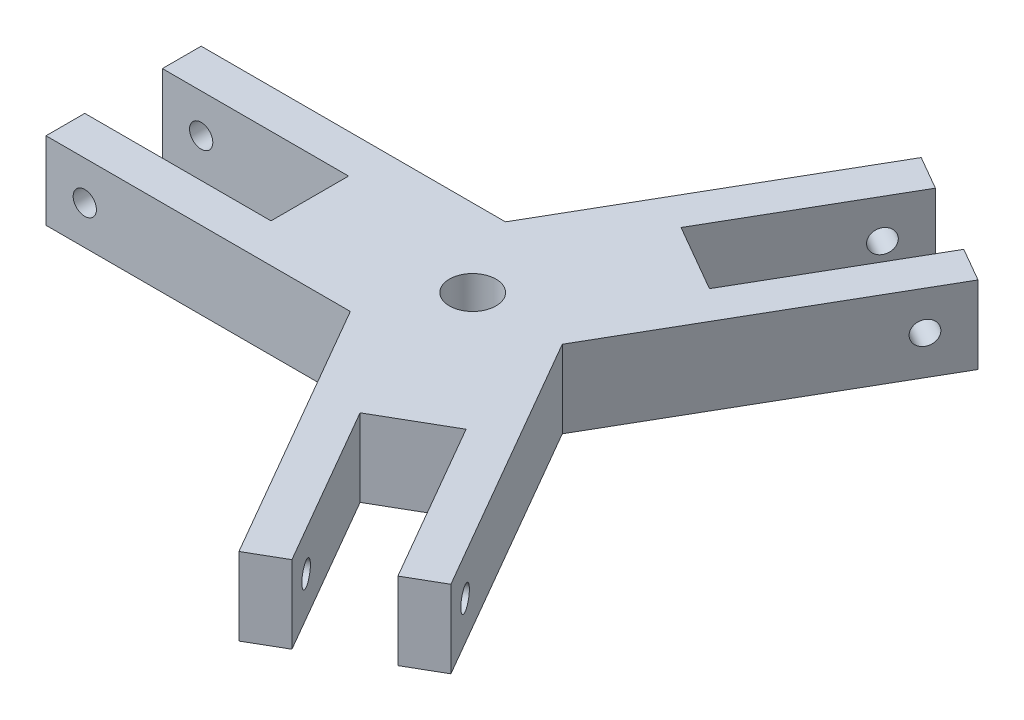
ISO-10303-21;
HEADER;
FILE_DESCRIPTION(('STEP AP214'),'2;1');
FILE_NAME('part.step','',(''),(''),'','','');
FILE_SCHEMA(('AUTOMOTIVE_DESIGN { 1 0 10303 214 1 1 1 1 }'));
ENDSEC;
DATA;
#1=APPLICATION_CONTEXT('core data for automotive mechanical design processes');
#2=APPLICATION_PROTOCOL_DEFINITION('international standard','automotive_design',2000,#1);
#3=PRODUCT_CONTEXT('',#1,'mechanical');
#4=PRODUCT('Part','Part','',(#3));
#5=PRODUCT_RELATED_PRODUCT_CATEGORY('part','',(#4));
#6=PRODUCT_DEFINITION_FORMATION('','',#4);
#7=PRODUCT_DEFINITION_CONTEXT('part definition',#1,'design');
#8=PRODUCT_DEFINITION('design','',#6,#7);
#9=PRODUCT_DEFINITION_SHAPE('','',#8);
#10=(LENGTH_UNIT() NAMED_UNIT(*) SI_UNIT(.MILLI.,.METRE.));
#11=(NAMED_UNIT(*) PLANE_ANGLE_UNIT() SI_UNIT($,.RADIAN.));
#12=(NAMED_UNIT(*) SI_UNIT($,.STERADIAN.) SOLID_ANGLE_UNIT());
#13=UNCERTAINTY_MEASURE_WITH_UNIT(LENGTH_MEASURE(1.E-05),#10,'distance_accuracy_value','');
#14=(GEOMETRIC_REPRESENTATION_CONTEXT(3) GLOBAL_UNCERTAINTY_ASSIGNED_CONTEXT((#13)) GLOBAL_UNIT_ASSIGNED_CONTEXT((#10,
#11,#12)) REPRESENTATION_CONTEXT('',''));
#15=CARTESIAN_POINT('',(0.,0.,0.));
#16=DIRECTION('',(0.,0.,1.));
#17=DIRECTION('',(1.,0.,0.));
#18=AXIS2_PLACEMENT_3D('',#15,#16,#17);
#19=CARTESIAN_POINT('',(13.8397459621552,0.,-43.9711431702999));
#20=DIRECTION('',(-0.499999999999992,0.,0.866025403784443));
#21=DIRECTION('',(0.866025403784443,0.,0.499999999999992));
#22=AXIS2_PLACEMENT_3D('',#19,#20,#21);
#23=PLANE('',#22);
#24=DIRECTION('',(0.866025403784443,0.,0.499999999999992));
#25=VECTOR('',#24,1.);
#26=CARTESIAN_POINT('',(13.8397459621552,9.99999999999999,-43.9711431702999));
#27=LINE('',#26,#25);
#28=CARTESIAN_POINT('',(13.8397459621552,9.99999999999999,-43.9711431702999));
#29=VERTEX_POINT('',#28);
#30=CARTESIAN_POINT('',(18.1698729810774,9.99999999999999,-41.4711431702999));
#31=VERTEX_POINT('',#30);
#32=EDGE_CURVE('E268',#29,#31,#27,.T.);
#33=ORIENTED_EDGE('',*,*,#32,.T.);
#34=DIRECTION('',(0.,1.,0.));
#35=VECTOR('',#34,1.);
#36=CARTESIAN_POINT('',(18.1698729810774,0.,-41.4711431702999));
#37=LINE('',#36,#35);
#38=CARTESIAN_POINT('',(18.1698729810774,0.,-41.4711431702999));
#39=VERTEX_POINT('',#38);
#40=EDGE_CURVE('E213',#39,#31,#37,.T.);
#41=ORIENTED_EDGE('',*,*,#40,.F.);
#42=DIRECTION('',(0.866025403784443,0.,0.499999999999992));
#43=VECTOR('',#42,1.);
#44=CARTESIAN_POINT('',(13.8397459621552,0.,-43.9711431702999));
#45=LINE('',#44,#43);
#46=CARTESIAN_POINT('',(13.8397459621552,0.,-43.9711431702999));
#47=VERTEX_POINT('',#46);
#48=EDGE_CURVE('E265',#47,#39,#45,.T.);
#49=ORIENTED_EDGE('',*,*,#48,.F.);
#50=DIRECTION('',(0.,-1.,0.));
#51=VECTOR('',#50,1.);
#52=CARTESIAN_POINT('',(13.8397459621552,0.,-43.9711431702999));
#53=LINE('',#52,#51);
#54=EDGE_CURVE('E252',#29,#47,#53,.T.);
#55=ORIENTED_EDGE('',*,*,#54,.F.);
#56=EDGE_LOOP('',(#33,#41,#49,#55));
#57=FACE_BOUND('',#56,.T.);
#58=ADVANCED_FACE('F33',(#57),#23,.F.);
#59=CARTESIAN_POINT('',(62.4102540378442,5.,-10.1554445662283));
#60=DIRECTION('',(-0.866025403784443,0.,-0.499999999999992));
#61=DIRECTION('',(-0.499999999999992,0.,0.866025403784443));
#62=AXIS2_PLACEMENT_3D('',#59,#60,#61);
#63=CYLINDRICAL_SURFACE('',#62,1.5);
#64=CARTESIAN_POINT('',(15.6698729810775,5.,-37.1410161513777));
#65=DIRECTION('',(-0.866025403784443,0.,-0.499999999999992));
#66=DIRECTION('',(-0.499999999999992,0.,0.866025403784443));
#67=AXIS2_PLACEMENT_3D('',#64,#65,#66);
#68=CIRCLE('',#67,1.5);
#69=CARTESIAN_POINT('',(14.9198729810775,5.,-35.841978045701));
#70=VERTEX_POINT('',#69);
#71=EDGE_CURVE('E37',#70,#70,#68,.F.);
#72=ORIENTED_EDGE('',*,*,#71,.T.);
#73=EDGE_LOOP('',(#72));
#74=FACE_BOUND('',#73,.T.);
#75=CARTESIAN_POINT('',(11.3397459621553,5.,-39.6410161513776));
#76=DIRECTION('',(-0.866025403784443,0.,-0.499999999999992));
#77=DIRECTION('',(-0.499999999999992,0.,0.866025403784443));
#78=AXIS2_PLACEMENT_3D('',#75,#76,#77);
#79=CIRCLE('',#78,1.5);
#80=CARTESIAN_POINT('',(10.5897459621553,5.,-38.341978045701));
#81=VERTEX_POINT('',#80);
#82=EDGE_CURVE('E241',#81,#81,#79,.T.);
#83=ORIENTED_EDGE('',*,*,#82,.T.);
#84=EDGE_LOOP('',(#83));
#85=FACE_BOUND('',#84,.T.);
#86=ADVANCED_FACE('F375',(#74,#85),#63,.F.);
#87=CARTESIAN_POINT('',(31.1602540378445,0.,33.9711431702996));
#88=DIRECTION('',(-0.500000000000004,0.,-0.866025403784436));
#89=DIRECTION('',(-0.866025403784436,0.,0.500000000000004));
#90=AXIS2_PLACEMENT_3D('',#87,#88,#89);
#91=PLANE('',#90);
#92=DIRECTION('',(-0.866025403784436,0.,0.500000000000004));
#93=VECTOR('',#92,1.);
#94=CARTESIAN_POINT('',(31.1602540378445,9.99999999999999,33.9711431702996));
#95=LINE('',#94,#93);
#96=CARTESIAN_POINT('',(31.1602540378445,9.99999999999999,33.9711431702996));
#97=VERTEX_POINT('',#96);
#98=CARTESIAN_POINT('',(26.8301270189224,9.99999999999999,36.4711431702996));
#99=VERTEX_POINT('',#98);
#100=EDGE_CURVE('E292',#97,#99,#95,.T.);
#101=ORIENTED_EDGE('',*,*,#100,.T.);
#102=DIRECTION('',(0.,1.,0.));
#103=VECTOR('',#102,1.);
#104=CARTESIAN_POINT('',(26.8301270189224,0.,36.4711431702996));
#105=LINE('',#104,#103);
#106=CARTESIAN_POINT('',(26.8301270189224,0.,36.4711431702996));
#107=VERTEX_POINT('',#106);
#108=EDGE_CURVE('E236',#107,#99,#105,.T.);
#109=ORIENTED_EDGE('',*,*,#108,.F.);
#110=DIRECTION('',(-0.866025403784436,0.,0.500000000000004));
#111=VECTOR('',#110,1.);
#112=CARTESIAN_POINT('',(31.1602540378445,0.,33.9711431702996));
#113=LINE('',#112,#111);
#114=CARTESIAN_POINT('',(31.1602540378445,0.,33.9711431702996));
#115=VERTEX_POINT('',#114);
#116=EDGE_CURVE('E288',#115,#107,#113,.T.);
#117=ORIENTED_EDGE('',*,*,#116,.F.);
#118=DIRECTION('',(0.,-1.,0.));
#119=VECTOR('',#118,1.);
#120=CARTESIAN_POINT('',(31.1602540378445,0.,33.9711431702996));
#121=LINE('',#120,#119);
#122=EDGE_CURVE('E274',#97,#115,#121,.T.);
#123=ORIENTED_EDGE('',*,*,#122,.F.);
#124=EDGE_LOOP('',(#101,#109,#117,#123));
#125=FACE_BOUND('',#124,.T.);
#126=ADVANCED_FACE('F399',(#125),#91,.F.);
#127=CARTESIAN_POINT('',(-32.7900635094608,5.,65.1193735291025));
#128=DIRECTION('',(0.866025403784436,0.,-0.500000000000004));
#129=DIRECTION('',(-0.500000000000004,0.,-0.866025403784436));
#130=AXIS2_PLACEMENT_3D('',#127,#128,#129);
#131=CYLINDRICAL_SURFACE('',#130,1.5);
#132=CARTESIAN_POINT('',(24.3301270189224,5.,32.1410161513774));
#133=DIRECTION('',(0.866025403784436,0.,-0.500000000000004));
#134=DIRECTION('',(-0.500000000000004,0.,-0.866025403784436));
#135=AXIS2_PLACEMENT_3D('',#132,#133,#134);
#136=CIRCLE('',#135,1.5);
#137=CARTESIAN_POINT('',(23.5801270189224,5.,30.8419780457008));
#138=VERTEX_POINT('',#137);
#139=EDGE_CURVE('E365',#138,#138,#136,.F.);
#140=ORIENTED_EDGE('',*,*,#139,.T.);
#141=EDGE_LOOP('',(#140));
#142=FACE_BOUND('',#141,.T.);
#143=CARTESIAN_POINT('',(28.6602540378445,5.,29.6410161513774));
#144=DIRECTION('',(0.866025403784436,0.,-0.500000000000004));
#145=DIRECTION('',(-0.500000000000004,0.,-0.866025403784436));
#146=AXIS2_PLACEMENT_3D('',#143,#144,#145);
#147=CIRCLE('',#146,1.5);
#148=CARTESIAN_POINT('',(27.9102540378445,5.,28.3419780457008));
#149=VERTEX_POINT('',#148);
#150=EDGE_CURVE('E246',#149,#149,#147,.T.);
#151=ORIENTED_EDGE('',*,*,#150,.T.);
#152=EDGE_LOOP('',(#151));
#153=FACE_BOUND('',#152,.T.);
#154=ADVANCED_FACE('F521',(#142,#153),#131,.F.);
#155=CARTESIAN_POINT('',(0.,0.,10.));
#156=DIRECTION('',(0.,0.,1.));
#157=DIRECTION('',(1.,0.,0.));
#158=AXIS2_PLACEMENT_3D('',#155,#156,#157);
#159=PLANE('',#158);
#160=CARTESIAN_POINT('',(-40.,5.,10.));
#161=DIRECTION('',(0.,0.,1.));
#162=DIRECTION('',(1.,0.,0.));
#163=AXIS2_PLACEMENT_3D('',#160,#161,#162);
#164=CIRCLE('',#163,1.5);
#165=CARTESIAN_POINT('',(-38.5,5.,10.));
#166=VERTEX_POINT('',#165);
#167=EDGE_CURVE('E328',#166,#166,#164,.T.);
#168=ORIENTED_EDGE('',*,*,#167,.F.);
#169=EDGE_LOOP('',(#168));
#170=FACE_BOUND('',#169,.T.);
#171=DIRECTION('',(1.,0.,0.));
#172=VECTOR('',#171,1.);
#173=CARTESIAN_POINT('',(0.,0.,10.));
#174=LINE('',#173,#172);
#175=CARTESIAN_POINT('',(-45.,0.,10.));
#176=VERTEX_POINT('',#175);
#177=CARTESIAN_POINT('',(-5.77350269189623,0.,10.));
#178=VERTEX_POINT('',#177);
#179=EDGE_CURVE('E338',#176,#178,#174,.T.);
#180=ORIENTED_EDGE('',*,*,#179,.T.);
#181=DIRECTION('',(0.,1.,0.));
#182=VECTOR('',#181,1.);
#183=CARTESIAN_POINT('',(-5.77350269189623,0.,10.));
#184=LINE('',#183,#182);
#185=CARTESIAN_POINT('',(-5.77350269189623,10.,10.));
#186=VERTEX_POINT('',#185);
#187=EDGE_CURVE('E11',#178,#186,#184,.T.);
#188=ORIENTED_EDGE('',*,*,#187,.T.);
#189=DIRECTION('',(-1.,0.,0.));
#190=VECTOR('',#189,1.);
#191=CARTESIAN_POINT('',(0.,10.,10.));
#192=LINE('',#191,#190);
#193=CARTESIAN_POINT('',(-45.,9.99999999999999,10.));
#194=VERTEX_POINT('',#193);
#195=EDGE_CURVE('E333',#186,#194,#192,.T.);
#196=ORIENTED_EDGE('',*,*,#195,.T.);
#197=DIRECTION('',(0.,-1.,0.));
#198=VECTOR('',#197,1.);
#199=CARTESIAN_POINT('',(-45.,0.,10.));
#200=LINE('',#199,#198);
#201=EDGE_CURVE('E335',#194,#176,#200,.T.);
#202=ORIENTED_EDGE('',*,*,#201,.T.);
#203=EDGE_LOOP('',(#180,#188,#196,#202));
#204=FACE_BOUND('',#203,.T.);
#205=ADVANCED_FACE('F446',(#170,#204),#159,.T.);
#206=CARTESIAN_POINT('',(-45.,0.,10.));
#207=DIRECTION('',(1.,0.,0.));
#208=DIRECTION('',(0.,0.,-1.));
#209=AXIS2_PLACEMENT_3D('',#206,#207,#208);
#210=PLANE('',#209);
#211=DIRECTION('',(0.,0.,-1.));
#212=VECTOR('',#211,1.);
#213=CARTESIAN_POINT('',(-45.,9.99999999999999,10.));
#214=LINE('',#213,#212);
#215=CARTESIAN_POINT('',(-45.,9.99999999999999,5.));
#216=VERTEX_POINT('',#215);
#217=EDGE_CURVE('E352',#194,#216,#214,.T.);
#218=ORIENTED_EDGE('',*,*,#217,.T.);
#219=DIRECTION('',(0.,1.,0.));
#220=VECTOR('',#219,1.);
#221=CARTESIAN_POINT('',(-45.,0.,5.));
#222=LINE('',#221,#220);
#223=CARTESIAN_POINT('',(-45.,0.,5.));
#224=VERTEX_POINT('',#223);
#225=EDGE_CURVE('E319',#224,#216,#222,.T.);
#226=ORIENTED_EDGE('',*,*,#225,.F.);
#227=DIRECTION('',(0.,0.,-1.));
#228=VECTOR('',#227,1.);
#229=CARTESIAN_POINT('',(-45.,0.,10.));
#230=LINE('',#229,#228);
#231=EDGE_CURVE('E348',#176,#224,#230,.T.);
#232=ORIENTED_EDGE('',*,*,#231,.F.);
#233=ORIENTED_EDGE('',*,*,#201,.F.);
#234=EDGE_LOOP('',(#218,#226,#232,#233));
#235=FACE_BOUND('',#234,.T.);
#236=ADVANCED_FACE('F453',(#235),#210,.F.);
#237=CARTESIAN_POINT('',(-40.,5.,-10.));
#238=DIRECTION('',(0.,0.,1.));
#239=DIRECTION('',(1.,0.,0.));
#240=AXIS2_PLACEMENT_3D('',#237,#238,#239);
#241=CYLINDRICAL_SURFACE('',#240,1.5);
#242=CARTESIAN_POINT('',(-40.,5.,5.));
#243=DIRECTION('',(0.,0.,1.));
#244=DIRECTION('',(1.,0.,0.));
#245=AXIS2_PLACEMENT_3D('',#242,#243,#244);
#246=CIRCLE('',#245,1.5);
#247=CARTESIAN_POINT('',(-38.5,5.,5.));
#248=VERTEX_POINT('',#247);
#249=EDGE_CURVE('E329',#248,#248,#246,.F.);
#250=ORIENTED_EDGE('',*,*,#249,.T.);
#251=EDGE_LOOP('',(#250));
#252=FACE_BOUND('',#251,.T.);
#253=ORIENTED_EDGE('',*,*,#167,.T.);
#254=EDGE_LOOP('',(#253));
#255=FACE_BOUND('',#254,.T.);
#256=ADVANCED_FACE('F488',(#252,#255),#241,.F.);
#257=CARTESIAN_POINT('',(0.,10.,10.));
#258=DIRECTION('',(0.,-1.,0.));
#259=DIRECTION('',(1.,0.,0.));
#260=AXIS2_PLACEMENT_3D('',#257,#258,#259);
#261=PLANE('',#260);
#262=CARTESIAN_POINT('',(0.,10.,0.));
#263=DIRECTION('',(0.,1.,0.));
#264=DIRECTION('',(-1.,0.,0.));
#265=AXIS2_PLACEMENT_3D('',#262,#263,#264);
#266=CIRCLE('',#265,3.);
#267=CARTESIAN_POINT('',(-3.,10.,0.));
#268=VERTEX_POINT('',#267);
#269=EDGE_CURVE('E203',#268,#268,#266,.T.);
#270=ORIENTED_EDGE('',*,*,#269,.F.);
#271=EDGE_LOOP('',(#270));
#272=FACE_BOUND('',#271,.T.);
#273=DIRECTION('',(0.866025403784443,0.,0.499999999999992));
#274=VECTOR('',#273,1.);
#275=CARTESIAN_POINT('',(14.830127018922,10.,-15.6865334794733));
#276=LINE('',#275,#274);
#277=CARTESIAN_POINT('',(6.16987298107761,10.,-20.6865334794733));
#278=VERTEX_POINT('',#277);
#279=CARTESIAN_POINT('',(14.830127018922,10.,-15.6865334794733));
#280=VERTEX_POINT('',#279);
#281=EDGE_CURVE('E185',#278,#280,#276,.T.);
#282=ORIENTED_EDGE('',*,*,#281,.F.);
#283=DIRECTION('',(-0.499999999999992,0.,0.866025403784443));
#284=VECTOR('',#283,1.);
#285=CARTESIAN_POINT('',(6.16987298107761,10.,-20.6865334794733));
#286=LINE('',#285,#284);
#287=EDGE_CURVE('E198',#31,#278,#286,.T.);
#288=ORIENTED_EDGE('',*,*,#287,.F.);
#289=ORIENTED_EDGE('',*,*,#32,.F.);
#290=DIRECTION('',(0.499999999999992,0.,-0.866025403784443));
#291=VECTOR('',#290,1.);
#292=CARTESIAN_POINT('',(-8.66025403784443,10.,-4.99999999999992));
#293=LINE('',#292,#291);
#294=CARTESIAN_POINT('',(-5.77350269189632,10.,-10.));
#295=VERTEX_POINT('',#294);
#296=EDGE_CURVE('E250',#295,#29,#293,.T.);
#297=ORIENTED_EDGE('',*,*,#296,.F.);
#298=DIRECTION('',(-1.,0.,0.));
#299=VECTOR('',#298,1.);
#300=CARTESIAN_POINT('',(0.,10.,-10.));
#301=LINE('',#300,#299);
#302=CARTESIAN_POINT('',(-45.,9.99999999999999,-10.));
#303=VERTEX_POINT('',#302);
#304=EDGE_CURVE('E332',#295,#303,#301,.T.);
#305=ORIENTED_EDGE('',*,*,#304,.T.);
#306=CARTESIAN_POINT('',(-45.,9.99999999999999,-5.));
#307=VERTEX_POINT('',#306);
#308=EDGE_CURVE('E351',#307,#303,#214,.T.);
#309=ORIENTED_EDGE('',*,*,#308,.F.);
#310=DIRECTION('',(-1.,0.,0.));
#311=VECTOR('',#310,1.);
#312=CARTESIAN_POINT('',(-21.,10.,-5.));
#313=LINE('',#312,#311);
#314=CARTESIAN_POINT('',(-21.,10.,-5.));
#315=VERTEX_POINT('',#314);
#316=EDGE_CURVE('E312',#315,#307,#313,.T.);
#317=ORIENTED_EDGE('',*,*,#316,.F.);
#318=DIRECTION('',(0.,0.,-1.));
#319=VECTOR('',#318,1.);
#320=CARTESIAN_POINT('',(-21.,10.,-5.));
#321=LINE('',#320,#319);
#322=CARTESIAN_POINT('',(-21.,10.,5.));
#323=VERTEX_POINT('',#322);
#324=EDGE_CURVE('E298',#323,#315,#321,.T.);
#325=ORIENTED_EDGE('',*,*,#324,.F.);
#326=DIRECTION('',(1.,0.,0.));
#327=VECTOR('',#326,1.);
#328=CARTESIAN_POINT('',(-21.,10.,5.));
#329=LINE('',#328,#327);
#330=EDGE_CURVE('E303',#216,#323,#329,.T.);
#331=ORIENTED_EDGE('',*,*,#330,.F.);
#332=ORIENTED_EDGE('',*,*,#217,.F.);
#333=ORIENTED_EDGE('',*,*,#195,.F.);
#334=DIRECTION('',(0.500000000000004,0.,0.866025403784436));
#335=VECTOR('',#334,1.);
#336=CARTESIAN_POINT('',(-8.66025403784436,10.,5.00000000000004));
#337=LINE('',#336,#335);
#338=CARTESIAN_POINT('',(13.8397459621558,9.99999999999999,43.9711431702997));
#339=VERTEX_POINT('',#338);
#340=EDGE_CURVE('E271',#186,#339,#337,.T.);
#341=ORIENTED_EDGE('',*,*,#340,.T.);
#342=CARTESIAN_POINT('',(18.169872981078,9.99999999999999,41.4711431702997));
#343=VERTEX_POINT('',#342);
#344=EDGE_CURVE('E291',#343,#339,#95,.T.);
#345=ORIENTED_EDGE('',*,*,#344,.F.);
#346=DIRECTION('',(0.500000000000004,0.,0.866025403784436));
#347=VECTOR('',#346,1.);
#348=CARTESIAN_POINT('',(6.1698729810779,10.,20.6865334794732));
#349=LINE('',#348,#347);
#350=CARTESIAN_POINT('',(6.1698729810779,10.,20.6865334794732));
#351=VERTEX_POINT('',#350);
#352=EDGE_CURVE('E58',#351,#343,#349,.T.);
#353=ORIENTED_EDGE('',*,*,#352,.F.);
#354=DIRECTION('',(-0.866025403784436,0.,0.500000000000004));
#355=VECTOR('',#354,1.);
#356=CARTESIAN_POINT('',(6.1698729810779,10.,20.6865334794732));
#357=LINE('',#356,#355);
#358=CARTESIAN_POINT('',(14.8301270189223,10.,15.6865334794731));
#359=VERTEX_POINT('',#358);
#360=EDGE_CURVE('E227',#359,#351,#357,.T.);
#361=ORIENTED_EDGE('',*,*,#360,.F.);
#362=DIRECTION('',(-0.500000000000004,0.,-0.866025403784436));
#363=VECTOR('',#362,1.);
#364=CARTESIAN_POINT('',(14.8301270189223,10.,15.6865334794731));
#365=LINE('',#364,#363);
#366=EDGE_CURVE('E220',#99,#359,#365,.T.);
#367=ORIENTED_EDGE('',*,*,#366,.F.);
#368=ORIENTED_EDGE('',*,*,#100,.F.);
#369=DIRECTION('',(0.500000000000004,0.,0.866025403784436));
#370=VECTOR('',#369,1.);
#371=CARTESIAN_POINT('',(8.66025403784436,10.,-5.00000000000004));
#372=LINE('',#371,#370);
#373=CARTESIAN_POINT('',(11.5470053837925,10.,0.));
#374=VERTEX_POINT('',#373);
#375=EDGE_CURVE('E272',#374,#97,#372,.T.);
#376=ORIENTED_EDGE('',*,*,#375,.F.);
#377=DIRECTION('',(0.499999999999992,0.,-0.866025403784443));
#378=VECTOR('',#377,1.);
#379=CARTESIAN_POINT('',(8.66025403784443,10.,4.99999999999992));
#380=LINE('',#379,#378);
#381=CARTESIAN_POINT('',(31.1602540378441,9.99999999999999,-33.9711431703));
#382=VERTEX_POINT('',#381);
#383=EDGE_CURVE('E249',#374,#382,#380,.T.);
#384=ORIENTED_EDGE('',*,*,#383,.T.);
#385=CARTESIAN_POINT('',(26.8301270189219,9.99999999999999,-36.4711431703));
#386=VERTEX_POINT('',#385);
#387=EDGE_CURVE('E267',#386,#382,#27,.T.);
#388=ORIENTED_EDGE('',*,*,#387,.F.);
#389=DIRECTION('',(0.499999999999992,0.,-0.866025403784443));
#390=VECTOR('',#389,1.);
#391=CARTESIAN_POINT('',(14.830127018922,10.,-15.6865334794733));
#392=LINE('',#391,#390);
#393=EDGE_CURVE('E50',#280,#386,#392,.T.);
#394=ORIENTED_EDGE('',*,*,#393,.F.);
#395=EDGE_LOOP('',(#282,#288,#289,#297,#305,#309,#317,#325,#331,#332,#333,#341,#345,#353,#361,
#367,#368,#376,#384,#388,#394));
#396=FACE_BOUND('',#395,.T.);
#397=ADVANCED_FACE('F35',(#272,#396),#261,.F.);
#398=CARTESIAN_POINT('',(-45.,0.,-5.));
#399=VERTEX_POINT('',#398);
#400=CARTESIAN_POINT('',(-45.,0.,-10.));
#401=VERTEX_POINT('',#400);
#402=EDGE_CURVE('E341',#399,#401,#230,.T.);
#403=ORIENTED_EDGE('',*,*,#402,.F.);
#404=DIRECTION('',(0.,1.,0.));
#405=VECTOR('',#404,1.);
#406=CARTESIAN_POINT('',(-45.,0.,-5.));
#407=LINE('',#406,#405);
#408=EDGE_CURVE('E321',#399,#307,#407,.T.);
#409=ORIENTED_EDGE('',*,*,#408,.T.);
#410=ORIENTED_EDGE('',*,*,#308,.T.);
#411=DIRECTION('',(0.,-1.,0.));
#412=VECTOR('',#411,1.);
#413=CARTESIAN_POINT('',(-45.,0.,-10.));
#414=LINE('',#413,#412);
#415=EDGE_CURVE('E343',#303,#401,#414,.T.);
#416=ORIENTED_EDGE('',*,*,#415,.T.);
#417=EDGE_LOOP('',(#403,#409,#410,#416));
#418=FACE_BOUND('',#417,.T.);
#419=ADVANCED_FACE('F469',(#418),#210,.F.);
#420=CARTESIAN_POINT('',(0.,0.,10.));
#421=DIRECTION('',(0.,1.,0.));
#422=DIRECTION('',(-1.,0.,0.));
#423=AXIS2_PLACEMENT_3D('',#420,#421,#422);
#424=PLANE('',#423);
#425=CARTESIAN_POINT('',(0.,0.,0.));
#426=DIRECTION('',(0.,1.,0.));
#427=DIRECTION('',(-1.,0.,0.));
#428=AXIS2_PLACEMENT_3D('',#425,#426,#427);
#429=CIRCLE('',#428,3.);
#430=CARTESIAN_POINT('',(-3.,0.,0.));
#431=VERTEX_POINT('',#430);
#432=EDGE_CURVE('E208',#431,#431,#429,.T.);
#433=ORIENTED_EDGE('',*,*,#432,.T.);
#434=EDGE_LOOP('',(#433));
#435=FACE_BOUND('',#434,.T.);
#436=ORIENTED_EDGE('',*,*,#48,.T.);
#437=DIRECTION('',(-0.499999999999992,0.,0.866025403784443));
#438=VECTOR('',#437,1.);
#439=CARTESIAN_POINT('',(6.16987298107761,0.,-20.6865334794733));
#440=LINE('',#439,#438);
#441=CARTESIAN_POINT('',(6.16987298107761,0.,-20.6865334794733));
#442=VERTEX_POINT('',#441);
#443=EDGE_CURVE('E187',#39,#442,#440,.T.);
#444=ORIENTED_EDGE('',*,*,#443,.T.);
#445=DIRECTION('',(0.866025403784443,0.,0.499999999999992));
#446=VECTOR('',#445,1.);
#447=CARTESIAN_POINT('',(14.830127018922,0.,-15.6865334794733));
#448=LINE('',#447,#446);
#449=CARTESIAN_POINT('',(14.830127018922,0.,-15.6865334794733));
#450=VERTEX_POINT('',#449);
#451=EDGE_CURVE('E182',#442,#450,#448,.T.);
#452=ORIENTED_EDGE('',*,*,#451,.T.);
#453=DIRECTION('',(0.499999999999992,0.,-0.866025403784443));
#454=VECTOR('',#453,1.);
#455=CARTESIAN_POINT('',(14.830127018922,0.,-15.6865334794733));
#456=LINE('',#455,#454);
#457=CARTESIAN_POINT('',(26.8301270189219,0.,-36.4711431703));
#458=VERTEX_POINT('',#457);
#459=EDGE_CURVE('E190',#450,#458,#456,.T.);
#460=ORIENTED_EDGE('',*,*,#459,.T.);
#461=CARTESIAN_POINT('',(31.1602540378441,0.,-33.9711431703));
#462=VERTEX_POINT('',#461);
#463=EDGE_CURVE('E257',#458,#462,#45,.T.);
#464=ORIENTED_EDGE('',*,*,#463,.T.);
#465=DIRECTION('',(-0.499999999999992,0.,0.866025403784443));
#466=VECTOR('',#465,1.);
#467=CARTESIAN_POINT('',(8.66025403784443,0.,4.99999999999992));
#468=LINE('',#467,#466);
#469=CARTESIAN_POINT('',(11.5470053837925,0.,0.));
#470=VERTEX_POINT('',#469);
#471=EDGE_CURVE('E253',#462,#470,#468,.T.);
#472=ORIENTED_EDGE('',*,*,#471,.T.);
#473=DIRECTION('',(-0.500000000000004,0.,-0.866025403784436));
#474=VECTOR('',#473,1.);
#475=CARTESIAN_POINT('',(8.66025403784436,0.,-5.00000000000004));
#476=LINE('',#475,#474);
#477=EDGE_CURVE('E277',#115,#470,#476,.T.);
#478=ORIENTED_EDGE('',*,*,#477,.F.);
#479=ORIENTED_EDGE('',*,*,#116,.T.);
#480=DIRECTION('',(-0.500000000000004,0.,-0.866025403784436));
#481=VECTOR('',#480,1.);
#482=CARTESIAN_POINT('',(14.8301270189223,0.,15.6865334794731));
#483=LINE('',#482,#481);
#484=CARTESIAN_POINT('',(14.8301270189223,0.,15.6865334794731));
#485=VERTEX_POINT('',#484);
#486=EDGE_CURVE('E223',#107,#485,#483,.T.);
#487=ORIENTED_EDGE('',*,*,#486,.T.);
#488=DIRECTION('',(-0.866025403784436,0.,0.500000000000004));
#489=VECTOR('',#488,1.);
#490=CARTESIAN_POINT('',(6.1698729810779,0.,20.6865334794732));
#491=LINE('',#490,#489);
#492=CARTESIAN_POINT('',(6.1698729810779,0.,20.6865334794732));
#493=VERTEX_POINT('',#492);
#494=EDGE_CURVE('E216',#485,#493,#491,.T.);
#495=ORIENTED_EDGE('',*,*,#494,.T.);
#496=DIRECTION('',(0.500000000000004,0.,0.866025403784436));
#497=VECTOR('',#496,1.);
#498=CARTESIAN_POINT('',(6.1698729810779,0.,20.6865334794732));
#499=LINE('',#498,#497);
#500=CARTESIAN_POINT('',(18.169872981078,0.,41.4711431702997));
#501=VERTEX_POINT('',#500);
#502=EDGE_CURVE('E219',#493,#501,#499,.T.);
#503=ORIENTED_EDGE('',*,*,#502,.T.);
#504=CARTESIAN_POINT('',(13.8397459621558,0.,43.9711431702997));
#505=VERTEX_POINT('',#504);
#506=EDGE_CURVE('E280',#501,#505,#113,.T.);
#507=ORIENTED_EDGE('',*,*,#506,.T.);
#508=DIRECTION('',(-0.500000000000004,0.,-0.866025403784436));
#509=VECTOR('',#508,1.);
#510=CARTESIAN_POINT('',(-8.66025403784436,0.,5.00000000000004));
#511=LINE('',#510,#509);
#512=EDGE_CURVE('E275',#505,#178,#511,.T.);
#513=ORIENTED_EDGE('',*,*,#512,.T.);
#514=ORIENTED_EDGE('',*,*,#179,.F.);
#515=ORIENTED_EDGE('',*,*,#231,.T.);
#516=DIRECTION('',(1.,0.,0.));
#517=VECTOR('',#516,1.);
#518=CARTESIAN_POINT('',(-21.,0.,5.));
#519=LINE('',#518,#517);
#520=CARTESIAN_POINT('',(-21.,0.,5.));
#521=VERTEX_POINT('',#520);
#522=EDGE_CURVE('E306',#224,#521,#519,.T.);
#523=ORIENTED_EDGE('',*,*,#522,.T.);
#524=DIRECTION('',(0.,0.,-1.));
#525=VECTOR('',#524,1.);
#526=CARTESIAN_POINT('',(-21.,0.,-5.));
#527=LINE('',#526,#525);
#528=CARTESIAN_POINT('',(-21.,0.,-5.));
#529=VERTEX_POINT('',#528);
#530=EDGE_CURVE('E299',#521,#529,#527,.T.);
#531=ORIENTED_EDGE('',*,*,#530,.T.);
#532=DIRECTION('',(-1.,0.,0.));
#533=VECTOR('',#532,1.);
#534=CARTESIAN_POINT('',(-21.,0.,-5.));
#535=LINE('',#534,#533);
#536=EDGE_CURVE('E302',#529,#399,#535,.T.);
#537=ORIENTED_EDGE('',*,*,#536,.T.);
#538=ORIENTED_EDGE('',*,*,#402,.T.);
#539=DIRECTION('',(1.,0.,0.));
#540=VECTOR('',#539,1.);
#541=CARTESIAN_POINT('',(0.,0.,-10.));
#542=LINE('',#541,#540);
#543=CARTESIAN_POINT('',(-5.77350269189632,0.,-10.));
#544=VERTEX_POINT('',#543);
#545=EDGE_CURVE('E336',#401,#544,#542,.T.);
#546=ORIENTED_EDGE('',*,*,#545,.T.);
#547=DIRECTION('',(-0.499999999999992,0.,0.866025403784443));
#548=VECTOR('',#547,1.);
#549=CARTESIAN_POINT('',(-8.66025403784443,0.,-4.99999999999992));
#550=LINE('',#549,#548);
#551=EDGE_CURVE('E255',#47,#544,#550,.T.);
#552=ORIENTED_EDGE('',*,*,#551,.F.);
#553=EDGE_LOOP('',(#436,#444,#452,#460,#464,#472,#478,#479,#487,#495,#503,#507,#513,#514,#515,
#523,#531,#537,#538,#546,#552));
#554=FACE_BOUND('',#553,.T.);
#555=ADVANCED_FACE('F197',(#435,#554),#424,.F.);
#556=CARTESIAN_POINT('',(0.,0.,-10.));
#557=DIRECTION('',(0.,0.,1.));
#558=DIRECTION('',(1.,0.,0.));
#559=AXIS2_PLACEMENT_3D('',#556,#557,#558);
#560=PLANE('',#559);
#561=CARTESIAN_POINT('',(-40.,5.,-10.));
#562=DIRECTION('',(0.,0.,1.));
#563=DIRECTION('',(1.,0.,0.));
#564=AXIS2_PLACEMENT_3D('',#561,#562,#563);
#565=CIRCLE('',#564,1.5);
#566=CARTESIAN_POINT('',(-38.5,5.,-10.));
#567=VERTEX_POINT('',#566);
#568=EDGE_CURVE('E325',#567,#567,#565,.T.);
#569=ORIENTED_EDGE('',*,*,#568,.T.);
#570=EDGE_LOOP('',(#569));
#571=FACE_BOUND('',#570,.T.);
#572=ORIENTED_EDGE('',*,*,#304,.F.);
#573=DIRECTION('',(0.,-1.,0.));
#574=VECTOR('',#573,1.);
#575=CARTESIAN_POINT('',(-5.77350269189632,0.,-10.));
#576=LINE('',#575,#574);
#577=EDGE_CURVE('E42',#295,#544,#576,.T.);
#578=ORIENTED_EDGE('',*,*,#577,.T.);
#579=ORIENTED_EDGE('',*,*,#545,.F.);
#580=ORIENTED_EDGE('',*,*,#415,.F.);
#581=EDGE_LOOP('',(#572,#578,#579,#580));
#582=FACE_BOUND('',#581,.T.);
#583=ADVANCED_FACE('F476',(#571,#582),#560,.F.);
#584=CARTESIAN_POINT('',(-40.,5.,-5.));
#585=DIRECTION('',(0.,0.,-1.));
#586=DIRECTION('',(-1.,0.,0.));
#587=AXIS2_PLACEMENT_3D('',#584,#585,#586);
#588=CIRCLE('',#587,1.5);
#589=CARTESIAN_POINT('',(-41.5,5.,-5.));
#590=VERTEX_POINT('',#589);
#591=EDGE_CURVE('E318',#590,#590,#588,.F.);
#592=ORIENTED_EDGE('',*,*,#591,.T.);
#593=EDGE_LOOP('',(#592));
#594=FACE_BOUND('',#593,.T.);
#595=ORIENTED_EDGE('',*,*,#568,.F.);
#596=EDGE_LOOP('',(#595));
#597=FACE_BOUND('',#596,.T.);
#598=ADVANCED_FACE('F496',(#594,#597),#241,.F.);
#599=CARTESIAN_POINT('',(-21.,0.,5.));
#600=DIRECTION('',(0.,0.,1.));
#601=DIRECTION('',(1.,0.,0.));
#602=AXIS2_PLACEMENT_3D('',#599,#600,#601);
#603=PLANE('',#602);
#604=ORIENTED_EDGE('',*,*,#330,.T.);
#605=DIRECTION('',(0.,1.,0.));
#606=VECTOR('',#605,1.);
#607=CARTESIAN_POINT('',(-21.,0.,5.));
#608=LINE('',#607,#606);
#609=EDGE_CURVE('E316',#521,#323,#608,.T.);
#610=ORIENTED_EDGE('',*,*,#609,.F.);
#611=ORIENTED_EDGE('',*,*,#522,.F.);
#612=ORIENTED_EDGE('',*,*,#225,.T.);
#613=EDGE_LOOP('',(#604,#610,#611,#612));
#614=FACE_BOUND('',#613,.T.);
#615=ORIENTED_EDGE('',*,*,#249,.F.);
#616=EDGE_LOOP('',(#615));
#617=FACE_BOUND('',#616,.T.);
#618=ADVANCED_FACE('F456',(#614,#617),#603,.F.);
#619=CARTESIAN_POINT('',(-21.,0.,-5.));
#620=DIRECTION('',(0.,0.,-1.));
#621=DIRECTION('',(-1.,0.,0.));
#622=AXIS2_PLACEMENT_3D('',#619,#620,#621);
#623=PLANE('',#622);
#624=ORIENTED_EDGE('',*,*,#316,.T.);
#625=ORIENTED_EDGE('',*,*,#408,.F.);
#626=ORIENTED_EDGE('',*,*,#536,.F.);
#627=DIRECTION('',(0.,1.,0.));
#628=VECTOR('',#627,1.);
#629=CARTESIAN_POINT('',(-21.,0.,-5.));
#630=LINE('',#629,#628);
#631=EDGE_CURVE('E309',#529,#315,#630,.T.);
#632=ORIENTED_EDGE('',*,*,#631,.T.);
#633=EDGE_LOOP('',(#624,#625,#626,#632));
#634=FACE_BOUND('',#633,.T.);
#635=ORIENTED_EDGE('',*,*,#591,.F.);
#636=EDGE_LOOP('',(#635));
#637=FACE_BOUND('',#636,.T.);
#638=ADVANCED_FACE('F465',(#634,#637),#623,.F.);
#639=CARTESIAN_POINT('',(-21.,0.,-5.));
#640=DIRECTION('',(1.,0.,0.));
#641=DIRECTION('',(0.,1.,0.));
#642=AXIS2_PLACEMENT_3D('',#639,#640,#641);
#643=PLANE('',#642);
#644=ORIENTED_EDGE('',*,*,#324,.T.);
#645=ORIENTED_EDGE('',*,*,#631,.F.);
#646=ORIENTED_EDGE('',*,*,#530,.F.);
#647=ORIENTED_EDGE('',*,*,#609,.T.);
#648=EDGE_LOOP('',(#644,#645,#646,#647));
#649=FACE_BOUND('',#648,.T.);
#650=ADVANCED_FACE('F461',(#649),#643,.F.);
#651=CARTESIAN_POINT('',(-8.66025403784443,0.,-4.99999999999992));
#652=DIRECTION('',(-0.866025403784443,0.,-0.499999999999992));
#653=DIRECTION('',(-0.499999999999992,0.,0.866025403784443));
#654=AXIS2_PLACEMENT_3D('',#651,#652,#653);
#655=PLANE('',#654);
#656=ORIENTED_EDGE('',*,*,#82,.F.);
#657=EDGE_LOOP('',(#656));
#658=FACE_BOUND('',#657,.T.);
#659=ORIENTED_EDGE('',*,*,#577,.F.);
#660=ORIENTED_EDGE('',*,*,#296,.T.);
#661=ORIENTED_EDGE('',*,*,#54,.T.);
#662=ORIENTED_EDGE('',*,*,#551,.T.);
#663=EDGE_LOOP('',(#659,#660,#661,#662));
#664=FACE_BOUND('',#663,.T.);
#665=ADVANCED_FACE('F480',(#658,#664),#655,.T.);
#666=CARTESIAN_POINT('',(8.66025403784436,0.,-5.00000000000004));
#667=DIRECTION('',(0.866025403784436,0.,-0.500000000000004));
#668=DIRECTION('',(-0.500000000000004,0.,-0.866025403784436));
#669=AXIS2_PLACEMENT_3D('',#666,#667,#668);
#670=PLANE('',#669);
#671=ORIENTED_EDGE('',*,*,#150,.F.);
#672=EDGE_LOOP('',(#671));
#673=FACE_BOUND('',#672,.T.);
#674=ORIENTED_EDGE('',*,*,#477,.T.);
#675=DIRECTION('',(0.,1.,0.));
#676=VECTOR('',#675,1.);
#677=CARTESIAN_POINT('',(11.5470053837925,0.,0.));
#678=LINE('',#677,#676);
#679=EDGE_CURVE('E295',#470,#374,#678,.T.);
#680=ORIENTED_EDGE('',*,*,#679,.T.);
#681=ORIENTED_EDGE('',*,*,#375,.T.);
#682=ORIENTED_EDGE('',*,*,#122,.T.);
#683=EDGE_LOOP('',(#674,#680,#681,#682));
#684=FACE_BOUND('',#683,.T.);
#685=ADVANCED_FACE('F423',(#673,#684),#670,.T.);
#686=ORIENTED_EDGE('',*,*,#506,.F.);
#687=DIRECTION('',(0.,1.,0.));
#688=VECTOR('',#687,1.);
#689=CARTESIAN_POINT('',(18.169872981078,0.,41.4711431702997));
#690=LINE('',#689,#688);
#691=EDGE_CURVE('E238',#501,#343,#690,.T.);
#692=ORIENTED_EDGE('',*,*,#691,.T.);
#693=ORIENTED_EDGE('',*,*,#344,.T.);
#694=DIRECTION('',(0.,-1.,0.));
#695=VECTOR('',#694,1.);
#696=CARTESIAN_POINT('',(13.8397459621558,0.,43.9711431702997));
#697=LINE('',#696,#695);
#698=EDGE_CURVE('E283',#339,#505,#697,.T.);
#699=ORIENTED_EDGE('',*,*,#698,.T.);
#700=EDGE_LOOP('',(#686,#692,#693,#699));
#701=FACE_BOUND('',#700,.T.);
#702=ADVANCED_FACE('F414',(#701),#91,.F.);
#703=CARTESIAN_POINT('',(-8.66025403784436,0.,5.00000000000004));
#704=DIRECTION('',(0.866025403784436,0.,-0.500000000000004));
#705=DIRECTION('',(-0.500000000000004,0.,-0.866025403784436));
#706=AXIS2_PLACEMENT_3D('',#703,#704,#705);
#707=PLANE('',#706);
#708=CARTESIAN_POINT('',(11.3397459621558,5.,39.6410161513775));
#709=DIRECTION('',(0.866025403784436,0.,-0.500000000000004));
#710=DIRECTION('',(-0.500000000000004,0.,-0.866025403784436));
#711=AXIS2_PLACEMENT_3D('',#708,#709,#710);
#712=CIRCLE('',#711,1.5);
#713=CARTESIAN_POINT('',(10.5897459621558,5.,38.3419780457008));
#714=VERTEX_POINT('',#713);
#715=EDGE_CURVE('E244',#714,#714,#712,.T.);
#716=ORIENTED_EDGE('',*,*,#715,.T.);
#717=EDGE_LOOP('',(#716));
#718=FACE_BOUND('',#717,.T.);
#719=ORIENTED_EDGE('',*,*,#187,.F.);
#720=ORIENTED_EDGE('',*,*,#512,.F.);
#721=ORIENTED_EDGE('',*,*,#698,.F.);
#722=ORIENTED_EDGE('',*,*,#340,.F.);
#723=EDGE_LOOP('',(#719,#720,#721,#722));
#724=FACE_BOUND('',#723,.T.);
#725=ADVANCED_FACE('F406',(#718,#724),#707,.F.);
#726=ORIENTED_EDGE('',*,*,#463,.F.);
#727=DIRECTION('',(0.,1.,0.));
#728=VECTOR('',#727,1.);
#729=CARTESIAN_POINT('',(26.8301270189219,0.,-36.4711431703));
#730=LINE('',#729,#728);
#731=EDGE_CURVE('E186',#458,#386,#730,.T.);
#732=ORIENTED_EDGE('',*,*,#731,.T.);
#733=ORIENTED_EDGE('',*,*,#387,.T.);
#734=DIRECTION('',(0.,-1.,0.));
#735=VECTOR('',#734,1.);
#736=CARTESIAN_POINT('',(31.1602540378441,0.,-33.9711431703));
#737=LINE('',#736,#735);
#738=EDGE_CURVE('E260',#382,#462,#737,.T.);
#739=ORIENTED_EDGE('',*,*,#738,.T.);
#740=EDGE_LOOP('',(#726,#732,#733,#739));
#741=FACE_BOUND('',#740,.T.);
#742=ADVANCED_FACE('F395',(#741),#23,.F.);
#743=CARTESIAN_POINT('',(8.66025403784443,0.,4.99999999999992));
#744=DIRECTION('',(-0.866025403784443,0.,-0.499999999999992));
#745=DIRECTION('',(-0.499999999999992,0.,0.866025403784443));
#746=AXIS2_PLACEMENT_3D('',#743,#744,#745);
#747=PLANE('',#746);
#748=CARTESIAN_POINT('',(28.6602540378441,5.,-29.6410161513778));
#749=DIRECTION('',(-0.866025403784443,0.,-0.499999999999992));
#750=DIRECTION('',(-0.499999999999992,0.,0.866025403784443));
#751=AXIS2_PLACEMENT_3D('',#748,#749,#750);
#752=CIRCLE('',#751,1.5);
#753=CARTESIAN_POINT('',(27.9102540378441,5.,-28.3419780457011));
#754=VERTEX_POINT('',#753);
#755=EDGE_CURVE('E245',#754,#754,#752,.T.);
#756=ORIENTED_EDGE('',*,*,#755,.T.);
#757=EDGE_LOOP('',(#756));
#758=FACE_BOUND('',#757,.T.);
#759=ORIENTED_EDGE('',*,*,#679,.F.);
#760=ORIENTED_EDGE('',*,*,#471,.F.);
#761=ORIENTED_EDGE('',*,*,#738,.F.);
#762=ORIENTED_EDGE('',*,*,#383,.F.);
#763=EDGE_LOOP('',(#759,#760,#761,#762));
#764=FACE_BOUND('',#763,.T.);
#765=ADVANCED_FACE('F405',(#758,#764),#747,.F.);
#766=CARTESIAN_POINT('',(15.669872981078,5.,37.1410161513775));
#767=DIRECTION('',(-0.866025403784436,0.,0.500000000000004));
#768=DIRECTION('',(0.500000000000004,0.,0.866025403784436));
#769=AXIS2_PLACEMENT_3D('',#766,#767,#768);
#770=CIRCLE('',#769,1.5);
#771=CARTESIAN_POINT('',(16.419872981078,5.,38.4400542570541));
#772=VERTEX_POINT('',#771);
#773=EDGE_CURVE('E235',#772,#772,#770,.F.);
#774=ORIENTED_EDGE('',*,*,#773,.T.);
#775=EDGE_LOOP('',(#774));
#776=FACE_BOUND('',#775,.T.);
#777=ORIENTED_EDGE('',*,*,#715,.F.);
#778=EDGE_LOOP('',(#777));
#779=FACE_BOUND('',#778,.T.);
#780=ADVANCED_FACE('F412',(#776,#779),#131,.F.);
#781=CARTESIAN_POINT('',(24.3301270189219,5.,-32.1410161513778));
#782=DIRECTION('',(0.866025403784443,0.,0.499999999999992));
#783=DIRECTION('',(0.499999999999992,0.,-0.866025403784443));
#784=AXIS2_PLACEMENT_3D('',#781,#782,#783);
#785=CIRCLE('',#784,1.5);
#786=CARTESIAN_POINT('',(25.0801270189219,5.,-33.4400542570544));
#787=VERTEX_POINT('',#786);
#788=EDGE_CURVE('E212',#787,#787,#785,.F.);
#789=ORIENTED_EDGE('',*,*,#788,.T.);
#790=EDGE_LOOP('',(#789));
#791=FACE_BOUND('',#790,.T.);
#792=ORIENTED_EDGE('',*,*,#755,.F.);
#793=EDGE_LOOP('',(#792));
#794=FACE_BOUND('',#793,.T.);
#795=ADVANCED_FACE('F401',(#791,#794),#63,.F.);
#796=CARTESIAN_POINT('',(14.8301270189223,0.,15.6865334794731));
#797=DIRECTION('',(0.866025403784436,0.,-0.500000000000004));
#798=DIRECTION('',(-0.500000000000004,0.,-0.866025403784436));
#799=AXIS2_PLACEMENT_3D('',#796,#797,#798);
#800=PLANE('',#799);
#801=ORIENTED_EDGE('',*,*,#366,.T.);
#802=DIRECTION('',(0.,1.,0.));
#803=VECTOR('',#802,1.);
#804=CARTESIAN_POINT('',(14.8301270189223,0.,15.6865334794731));
#805=LINE('',#804,#803);
#806=EDGE_CURVE('E233',#485,#359,#805,.T.);
#807=ORIENTED_EDGE('',*,*,#806,.F.);
#808=ORIENTED_EDGE('',*,*,#486,.F.);
#809=ORIENTED_EDGE('',*,*,#108,.T.);
#810=EDGE_LOOP('',(#801,#807,#808,#809));
#811=FACE_BOUND('',#810,.T.);
#812=ORIENTED_EDGE('',*,*,#139,.F.);
#813=EDGE_LOOP('',(#812));
#814=FACE_BOUND('',#813,.T.);
#815=ADVANCED_FACE('F432',(#811,#814),#800,.F.);
#816=CARTESIAN_POINT('',(6.1698729810779,0.,20.6865334794732));
#817=DIRECTION('',(-0.866025403784436,0.,0.500000000000004));
#818=DIRECTION('',(0.500000000000004,0.,0.866025403784436));
#819=AXIS2_PLACEMENT_3D('',#816,#817,#818);
#820=PLANE('',#819);
#821=ORIENTED_EDGE('',*,*,#352,.T.);
#822=ORIENTED_EDGE('',*,*,#691,.F.);
#823=ORIENTED_EDGE('',*,*,#502,.F.);
#824=DIRECTION('',(0.,1.,0.));
#825=VECTOR('',#824,1.);
#826=CARTESIAN_POINT('',(6.1698729810779,0.,20.6865334794732));
#827=LINE('',#826,#825);
#828=EDGE_CURVE('E226',#493,#351,#827,.T.);
#829=ORIENTED_EDGE('',*,*,#828,.T.);
#830=EDGE_LOOP('',(#821,#822,#823,#829));
#831=FACE_BOUND('',#830,.T.);
#832=ORIENTED_EDGE('',*,*,#773,.F.);
#833=EDGE_LOOP('',(#832));
#834=FACE_BOUND('',#833,.T.);
#835=ADVANCED_FACE('F388',(#831,#834),#820,.F.);
#836=CARTESIAN_POINT('',(6.1698729810779,0.,20.6865334794732));
#837=DIRECTION('',(-0.500000000000004,0.,-0.866025403784436));
#838=DIRECTION('',(-0.866025403784436,0.,0.500000000000004));
#839=AXIS2_PLACEMENT_3D('',#836,#837,#838);
#840=PLANE('',#839);
#841=ORIENTED_EDGE('',*,*,#360,.T.);
#842=ORIENTED_EDGE('',*,*,#828,.F.);
#843=ORIENTED_EDGE('',*,*,#494,.F.);
#844=ORIENTED_EDGE('',*,*,#806,.T.);
#845=EDGE_LOOP('',(#841,#842,#843,#844));
#846=FACE_BOUND('',#845,.T.);
#847=ADVANCED_FACE('F380',(#846),#840,.F.);
#848=CARTESIAN_POINT('',(6.16987298107761,0.,-20.6865334794733));
#849=DIRECTION('',(-0.866025403784443,0.,-0.499999999999992));
#850=DIRECTION('',(-0.499999999999992,0.,0.866025403784443));
#851=AXIS2_PLACEMENT_3D('',#848,#849,#850);
#852=PLANE('',#851);
#853=ORIENTED_EDGE('',*,*,#287,.T.);
#854=DIRECTION('',(0.,1.,0.));
#855=VECTOR('',#854,1.);
#856=CARTESIAN_POINT('',(6.16987298107761,0.,-20.6865334794733));
#857=LINE('',#856,#855);
#858=EDGE_CURVE('E210',#442,#278,#857,.T.);
#859=ORIENTED_EDGE('',*,*,#858,.F.);
#860=ORIENTED_EDGE('',*,*,#443,.F.);
#861=ORIENTED_EDGE('',*,*,#40,.T.);
#862=EDGE_LOOP('',(#853,#859,#860,#861));
#863=FACE_BOUND('',#862,.T.);
#864=ORIENTED_EDGE('',*,*,#71,.F.);
#865=EDGE_LOOP('',(#864));
#866=FACE_BOUND('',#865,.T.);
#867=ADVANCED_FACE('F378',(#863,#866),#852,.F.);
#868=CARTESIAN_POINT('',(14.830127018922,0.,-15.6865334794733));
#869=DIRECTION('',(0.866025403784443,0.,0.499999999999992));
#870=DIRECTION('',(0.499999999999992,0.,-0.866025403784443));
#871=AXIS2_PLACEMENT_3D('',#868,#869,#870);
#872=PLANE('',#871);
#873=ORIENTED_EDGE('',*,*,#393,.T.);
#874=ORIENTED_EDGE('',*,*,#731,.F.);
#875=ORIENTED_EDGE('',*,*,#459,.F.);
#876=DIRECTION('',(0.,1.,0.));
#877=VECTOR('',#876,1.);
#878=CARTESIAN_POINT('',(14.830127018922,0.,-15.6865334794733));
#879=LINE('',#878,#877);
#880=EDGE_CURVE('E178',#450,#280,#879,.T.);
#881=ORIENTED_EDGE('',*,*,#880,.T.);
#882=EDGE_LOOP('',(#873,#874,#875,#881));
#883=FACE_BOUND('',#882,.T.);
#884=ORIENTED_EDGE('',*,*,#788,.F.);
#885=EDGE_LOOP('',(#884));
#886=FACE_BOUND('',#885,.T.);
#887=ADVANCED_FACE('F191',(#883,#886),#872,.F.);
#888=CARTESIAN_POINT('',(14.830127018922,0.,-15.6865334794733));
#889=DIRECTION('',(-0.499999999999992,0.,0.866025403784443));
#890=DIRECTION('',(0.866025403784443,0.,0.499999999999992));
#891=AXIS2_PLACEMENT_3D('',#888,#889,#890);
#892=PLANE('',#891);
#893=ORIENTED_EDGE('',*,*,#281,.T.);
#894=ORIENTED_EDGE('',*,*,#880,.F.);
#895=ORIENTED_EDGE('',*,*,#451,.F.);
#896=ORIENTED_EDGE('',*,*,#858,.T.);
#897=EDGE_LOOP('',(#893,#894,#895,#896));
#898=FACE_BOUND('',#897,.T.);
#899=ADVANCED_FACE('F180',(#898),#892,.F.);
#900=CARTESIAN_POINT('',(0.,0.,0.));
#901=DIRECTION('',(0.,1.,0.));
#902=DIRECTION('',(-1.,0.,0.));
#903=AXIS2_PLACEMENT_3D('',#900,#901,#902);
#904=CYLINDRICAL_SURFACE('',#903,3.);
#905=ORIENTED_EDGE('',*,*,#432,.F.);
#906=EDGE_LOOP('',(#905));
#907=FACE_BOUND('',#906,.T.);
#908=ORIENTED_EDGE('',*,*,#269,.T.);
#909=EDGE_LOOP('',(#908));
#910=FACE_BOUND('',#909,.T.);
#911=ADVANCED_FACE('F504',(#907,#910),#904,.F.);
#912=CLOSED_SHELL('',(#58,#86,#126,#154,#205,#236,#256,#397,#419,#555,#583,#598,#618,#638,#650,
#665,#685,#702,#725,#742,#765,#780,#795,#815,#835,#847,#867,#887,#899,#911));
#913=MANIFOLD_SOLID_BREP('B2',#912);
#914=ADVANCED_BREP_SHAPE_REPRESENTATION('',(#18,#913),#14);
#915=SHAPE_DEFINITION_REPRESENTATION(#9,#914);
ENDSEC;
END-ISO-10303-21;
